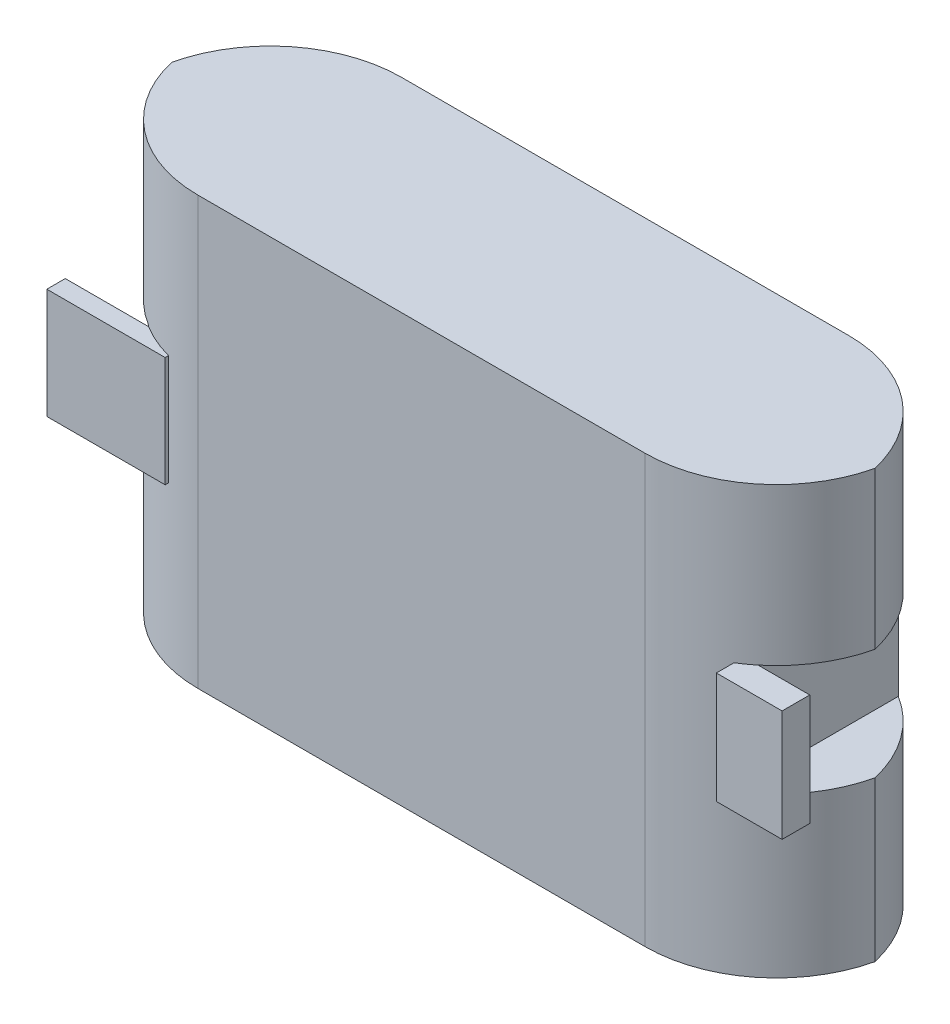
ISO-10303-21;
HEADER;
FILE_DESCRIPTION(('STEP AP214'),'2;1');
FILE_NAME('part.step','',(''),(''),'','','');
FILE_SCHEMA(('AUTOMOTIVE_DESIGN { 1 0 10303 214 1 1 1 1 }'));
ENDSEC;
DATA;
#1=APPLICATION_CONTEXT('core data for automotive mechanical design processes');
#2=APPLICATION_PROTOCOL_DEFINITION('international standard','automotive_design',2000,#1);
#3=PRODUCT_CONTEXT('',#1,'mechanical');
#4=PRODUCT('Part','Part','',(#3));
#5=PRODUCT_RELATED_PRODUCT_CATEGORY('part','',(#4));
#6=PRODUCT_DEFINITION_FORMATION('','',#4);
#7=PRODUCT_DEFINITION_CONTEXT('part definition',#1,'design');
#8=PRODUCT_DEFINITION('design','',#6,#7);
#9=PRODUCT_DEFINITION_SHAPE('','',#8);
#10=(LENGTH_UNIT() NAMED_UNIT(*) SI_UNIT(.MILLI.,.METRE.));
#11=(NAMED_UNIT(*) PLANE_ANGLE_UNIT() SI_UNIT($,.RADIAN.));
#12=(NAMED_UNIT(*) SI_UNIT($,.STERADIAN.) SOLID_ANGLE_UNIT());
#13=UNCERTAINTY_MEASURE_WITH_UNIT(LENGTH_MEASURE(1.E-05),#10,'distance_accuracy_value','');
#14=(GEOMETRIC_REPRESENTATION_CONTEXT(3) GLOBAL_UNCERTAINTY_ASSIGNED_CONTEXT((#13)) GLOBAL_UNIT_ASSIGNED_CONTEXT((#10,
#11,#12)) REPRESENTATION_CONTEXT('',''));
#15=CARTESIAN_POINT('',(0.,0.,0.));
#16=DIRECTION('',(0.,0.,1.));
#17=DIRECTION('',(1.,0.,0.));
#18=AXIS2_PLACEMENT_3D('',#15,#16,#17);
#19=CARTESIAN_POINT('',(63.5325033349829,12.9386866433361,28.));
#20=DIRECTION('',(0.,1.,0.));
#21=DIRECTION('',(0.,0.,1.));
#22=AXIS2_PLACEMENT_3D('',#19,#20,#21);
#23=PLANE('',#22);
#24=DIRECTION('',(-1.,0.,0.));
#25=VECTOR('',#24,1.);
#26=CARTESIAN_POINT('',(61.9962264458655,12.9386866433361,26.4710557876526));
#27=LINE('',#26,#25);
#28=CARTESIAN_POINT('',(54.1305620661384,12.9386866433361,26.4710557876526));
#29=VERTEX_POINT('',#28);
#30=CARTESIAN_POINT('',(51.9962264458655,12.9386866433361,26.4710557876526));
#31=VERTEX_POINT('',#30);
#32=EDGE_CURVE('E54',#29,#31,#27,.T.);
#33=ORIENTED_EDGE('',*,*,#32,.T.);
#34=DIRECTION('',(0.,0.,-1.));
#35=VECTOR('',#34,1.);
#36=CARTESIAN_POINT('',(51.9962264458655,12.9386866433361,28.));
#37=LINE('',#36,#35);
#38=CARTESIAN_POINT('',(51.9962264458655,12.9386866433361,3.00288145802275));
#39=VERTEX_POINT('',#38);
#40=EDGE_CURVE('E262',#31,#39,#37,.T.);
#41=ORIENTED_EDGE('',*,*,#40,.T.);
#42=CARTESIAN_POINT('',(41.4559246821601,12.9386866433361,20.));
#43=DIRECTION('',(0.,1.,0.));
#44=DIRECTION('',(0.,0.,1.));
#45=AXIS2_PLACEMENT_3D('',#42,#43,#44);
#46=CIRCLE('',#45,20.);
#47=CARTESIAN_POINT('',(60.9430999520651,12.9386866433361,15.5));
#48=VERTEX_POINT('',#47);
#49=EDGE_CURVE('E328',#39,#48,#46,.F.);
#50=ORIENTED_EDGE('',*,*,#49,.T.);
#51=CARTESIAN_POINT('',(41.4559246821601,12.9386866433361,11.));
#52=DIRECTION('',(0.,1.,0.));
#53=DIRECTION('',(0.,0.,1.));
#54=AXIS2_PLACEMENT_3D('',#51,#52,#53);
#55=CIRCLE('',#54,20.);
#56=EDGE_CURVE('E272',#48,#29,#55,.F.);
#57=ORIENTED_EDGE('',*,*,#56,.T.);
#58=EDGE_LOOP('',(#33,#41,#50,#57));
#59=FACE_BOUND('',#58,.T.);
#60=ADVANCED_FACE('F32',(#59),#23,.F.);
#61=CARTESIAN_POINT('',(51.9962264458655,12.9386866433361,28.));
#62=DIRECTION('',(-1.,0.,0.));
#63=DIRECTION('',(0.,0.,1.));
#64=AXIS2_PLACEMENT_3D('',#61,#62,#63);
#65=PLANE('',#64);
#66=DIRECTION('',(0.,1.,0.));
#67=VECTOR('',#66,1.);
#68=CARTESIAN_POINT('',(51.9962264458655,12.9386866433361,26.4710557876526));
#69=LINE('',#68,#67);
#70=CARTESIAN_POINT('',(51.9962264458655,-3.98873727723092,26.4710557876526));
#71=VERTEX_POINT('',#70);
#72=EDGE_CURVE('E594',#71,#31,#69,.T.);
#73=ORIENTED_EDGE('',*,*,#72,.F.);
#74=DIRECTION('',(0.,0.,-1.));
#75=VECTOR('',#74,1.);
#76=CARTESIAN_POINT('',(51.9962264458655,-3.98873727723092,28.));
#77=LINE('',#76,#75);
#78=CARTESIAN_POINT('',(51.9962264458655,-3.98873727723092,3.00288145802274));
#79=VERTEX_POINT('',#78);
#80=EDGE_CURVE('E261',#71,#79,#77,.T.);
#81=ORIENTED_EDGE('',*,*,#80,.T.);
#82=DIRECTION('',(0.,1.,0.));
#83=VECTOR('',#82,1.);
#84=CARTESIAN_POINT('',(51.9962264458655,36.7845192091454,3.00288145802275));
#85=LINE('',#84,#83);
#86=EDGE_CURVE('E325',#79,#39,#85,.T.);
#87=ORIENTED_EDGE('',*,*,#86,.T.);
#88=ORIENTED_EDGE('',*,*,#40,.F.);
#89=EDGE_LOOP('',(#73,#81,#87,#88));
#90=FACE_BOUND('',#89,.T.);
#91=ADVANCED_FACE('F381',(#90),#65,.F.);
#92=CARTESIAN_POINT('',(63.5325033349829,-3.98873727723092,28.));
#93=DIRECTION('',(0.,-1.,0.));
#94=DIRECTION('',(0.,0.,-1.));
#95=AXIS2_PLACEMENT_3D('',#92,#93,#94);
#96=PLANE('',#95);
#97=DIRECTION('',(-1.,0.,0.));
#98=VECTOR('',#97,1.);
#99=CARTESIAN_POINT('',(63.5325033349829,-3.98873727723092,26.4710557876526));
#100=LINE('',#99,#98);
#101=CARTESIAN_POINT('',(54.1305620661384,-3.98873727723092,26.4710557876526));
#102=VERTEX_POINT('',#101);
#103=EDGE_CURVE('E11',#102,#71,#100,.T.);
#104=ORIENTED_EDGE('',*,*,#103,.F.);
#105=CARTESIAN_POINT('',(41.4559246821601,-3.98873727723092,11.));
#106=DIRECTION('',(0.,-1.,0.));
#107=DIRECTION('',(0.,0.,-1.));
#108=AXIS2_PLACEMENT_3D('',#105,#106,#107);
#109=CIRCLE('',#108,20.);
#110=CARTESIAN_POINT('',(60.9430999520651,-3.98873727723092,15.5));
#111=VERTEX_POINT('',#110);
#112=EDGE_CURVE('E264',#102,#111,#109,.F.);
#113=ORIENTED_EDGE('',*,*,#112,.T.);
#114=CARTESIAN_POINT('',(41.4559246821601,-3.98873727723092,20.));
#115=DIRECTION('',(0.,-1.,0.));
#116=DIRECTION('',(0.,0.,-1.));
#117=AXIS2_PLACEMENT_3D('',#114,#115,#116);
#118=CIRCLE('',#117,20.);
#119=EDGE_CURVE('E316',#111,#79,#118,.F.);
#120=ORIENTED_EDGE('',*,*,#119,.T.);
#121=ORIENTED_EDGE('',*,*,#80,.F.);
#122=EDGE_LOOP('',(#104,#113,#120,#121));
#123=FACE_BOUND('',#122,.T.);
#124=ADVANCED_FACE('F386',(#123),#96,.F.);
#125=CARTESIAN_POINT('',(-26.5440753178399,0.,11.));
#126=DIRECTION('',(0.,1.,0.));
#127=DIRECTION('',(0.,0.,1.));
#128=AXIS2_PLACEMENT_3D('',#125,#126,#127);
#129=CYLINDRICAL_SURFACE('',#128,20.);
#130=CARTESIAN_POINT('',(-26.5440753178399,-3.98873727723092,11.));
#131=DIRECTION('',(0.,-1.,0.));
#132=DIRECTION('',(0.,0.,-1.));
#133=AXIS2_PLACEMENT_3D('',#130,#131,#132);
#134=CIRCLE('',#133,20.);
#135=CARTESIAN_POINT('',(-46.031250587745,-3.98873727723092,15.5));
#136=VERTEX_POINT('',#135);
#137=CARTESIAN_POINT('',(-37.0797290706927,-3.98873727723092,28.));
#138=VERTEX_POINT('',#137);
#139=EDGE_CURVE('E334',#136,#138,#134,.F.);
#140=ORIENTED_EDGE('',*,*,#139,.F.);
#141=DIRECTION('',(0.,-1.,0.));
#142=VECTOR('',#141,1.);
#143=CARTESIAN_POINT('',(-46.031250587745,4.28451920914537,15.5));
#144=LINE('',#143,#142);
#145=CARTESIAN_POINT('',(-46.031250587745,-28.2154807908546,15.5));
#146=VERTEX_POINT('',#145);
#147=EDGE_CURVE('E274',#136,#146,#144,.T.);
#148=ORIENTED_EDGE('',*,*,#147,.T.);
#149=CARTESIAN_POINT('',(-26.5440753178399,-28.2154807908546,11.));
#150=DIRECTION('',(0.,1.,0.));
#151=DIRECTION('',(0.,0.,1.));
#152=AXIS2_PLACEMENT_3D('',#149,#150,#151);
#153=CIRCLE('',#152,20.);
#154=CARTESIAN_POINT('',(-26.5440753178399,-28.2154807908546,31.));
#155=VERTEX_POINT('',#154);
#156=EDGE_CURVE('E303',#155,#146,#153,.F.);
#157=ORIENTED_EDGE('',*,*,#156,.F.);
#158=DIRECTION('',(0.,-1.,0.));
#159=VECTOR('',#158,1.);
#160=CARTESIAN_POINT('',(-26.5440753178399,-28.2154807908546,31.));
#161=LINE('',#160,#159);
#162=CARTESIAN_POINT('',(-26.5440753178399,36.7845192091454,31.));
#163=VERTEX_POINT('',#162);
#164=EDGE_CURVE('E311',#163,#155,#161,.T.);
#165=ORIENTED_EDGE('',*,*,#164,.F.);
#166=CARTESIAN_POINT('',(-26.5440753178399,36.7845192091454,11.));
#167=DIRECTION('',(0.,-1.,0.));
#168=DIRECTION('',(0.,0.,-1.));
#169=AXIS2_PLACEMENT_3D('',#166,#167,#168);
#170=CIRCLE('',#169,20.);
#171=CARTESIAN_POINT('',(-46.031250587745,36.7845192091454,15.5));
#172=VERTEX_POINT('',#171);
#173=EDGE_CURVE('E290',#172,#163,#170,.F.);
#174=ORIENTED_EDGE('',*,*,#173,.F.);
#175=CARTESIAN_POINT('',(-46.031250587745,12.9386866433361,15.5));
#176=VERTEX_POINT('',#175);
#177=EDGE_CURVE('E320',#172,#176,#144,.T.);
#178=ORIENTED_EDGE('',*,*,#177,.T.);
#179=CARTESIAN_POINT('',(-26.5440753178399,12.9386866433361,11.));
#180=DIRECTION('',(0.,1.,0.));
#181=DIRECTION('',(0.,0.,1.));
#182=AXIS2_PLACEMENT_3D('',#179,#180,#181);
#183=CIRCLE('',#182,20.);
#184=CARTESIAN_POINT('',(-37.0797290706927,12.9386866433361,28.));
#185=VERTEX_POINT('',#184);
#186=EDGE_CURVE('E332',#185,#176,#183,.F.);
#187=ORIENTED_EDGE('',*,*,#186,.F.);
#188=DIRECTION('',(0.,1.,0.));
#189=VECTOR('',#188,1.);
#190=CARTESIAN_POINT('',(-37.0797290706927,0.,28.));
#191=LINE('',#190,#189);
#192=EDGE_CURVE('E330',#138,#185,#191,.T.);
#193=ORIENTED_EDGE('',*,*,#192,.F.);
#194=EDGE_LOOP('',(#140,#148,#157,#165,#174,#178,#187,#193));
#195=FACE_BOUND('',#194,.T.);
#196=CARTESIAN_POINT('',(-26.5440753178399,-4.04277729188784,11.));
#197=DIRECTION('',(0.,1.,0.));
#198=DIRECTION('',(0.,0.,1.));
#199=AXIS2_PLACEMENT_3D('',#196,#197,#198);
#200=CIRCLE('',#199,20.);
#201=CARTESIAN_POINT('',(-31.6963827693399,-4.04277729188784,30.3249509165022));
#202=VERTEX_POINT('',#201);
#203=CARTESIAN_POINT('',(-37.0358921717604,-4.04277729188784,28.0270895664465));
#204=VERTEX_POINT('',#203);
#205=EDGE_CURVE('E345',#202,#204,#200,.F.);
#206=ORIENTED_EDGE('',*,*,#205,.T.);
#207=DIRECTION('',(0.,1.,0.));
#208=VECTOR('',#207,1.);
#209=CARTESIAN_POINT('',(-37.0358921717604,0.,28.0270895664465));
#210=LINE('',#209,#208);
#211=CARTESIAN_POINT('',(-37.0358921717604,12.7269551482598,28.0270895664465));
#212=VERTEX_POINT('',#211);
#213=EDGE_CURVE('E40',#204,#212,#210,.T.);
#214=ORIENTED_EDGE('',*,*,#213,.T.);
#215=CARTESIAN_POINT('',(-26.5440753178399,12.7269551482598,11.));
#216=DIRECTION('',(0.,-1.,0.));
#217=DIRECTION('',(0.,0.,-1.));
#218=AXIS2_PLACEMENT_3D('',#215,#216,#217);
#219=CIRCLE('',#218,20.);
#220=CARTESIAN_POINT('',(-31.6963827693399,12.7269551482598,30.3249509165022));
#221=VERTEX_POINT('',#220);
#222=EDGE_CURVE('E342',#212,#221,#219,.F.);
#223=ORIENTED_EDGE('',*,*,#222,.T.);
#224=DIRECTION('',(0.,1.,0.));
#225=VECTOR('',#224,1.);
#226=CARTESIAN_POINT('',(-31.6963827693399,0.,30.3249509165022));
#227=LINE('',#226,#225);
#228=EDGE_CURVE('E339',#221,#202,#227,.F.);
#229=ORIENTED_EDGE('',*,*,#228,.T.);
#230=EDGE_LOOP('',(#206,#214,#223,#229));
#231=FACE_BOUND('',#230,.T.);
#232=ADVANCED_FACE('F349',(#195,#231),#129,.T.);
#233=CARTESIAN_POINT('',(-46.5440753178399,-28.2154807908546,31.));
#234=DIRECTION('',(0.,1.,0.));
#235=DIRECTION('',(0.,0.,1.));
#236=AXIS2_PLACEMENT_3D('',#233,#234,#235);
#237=PLANE('',#236);
#238=DIRECTION('',(1.,0.,0.));
#239=VECTOR('',#238,1.);
#240=CARTESIAN_POINT('',(-46.5440753178399,-28.2154807908546,0.));
#241=LINE('',#240,#239);
#242=CARTESIAN_POINT('',(-26.5440753178399,-28.2154807908546,0.));
#243=VERTEX_POINT('',#242);
#244=CARTESIAN_POINT('',(41.4559246821601,-28.2154807908546,0.));
#245=VERTEX_POINT('',#244);
#246=EDGE_CURVE('E283',#243,#245,#241,.T.);
#247=ORIENTED_EDGE('',*,*,#246,.T.);
#248=CARTESIAN_POINT('',(41.4559246821601,-28.2154807908546,20.));
#249=DIRECTION('',(0.,1.,0.));
#250=DIRECTION('',(0.,0.,1.));
#251=AXIS2_PLACEMENT_3D('',#248,#249,#250);
#252=CIRCLE('',#251,20.);
#253=CARTESIAN_POINT('',(60.9430999520651,-28.2154807908546,15.5));
#254=VERTEX_POINT('',#253);
#255=EDGE_CURVE('E308',#245,#254,#252,.F.);
#256=ORIENTED_EDGE('',*,*,#255,.T.);
#257=CARTESIAN_POINT('',(41.4559246821601,-28.2154807908546,11.));
#258=DIRECTION('',(0.,1.,0.));
#259=DIRECTION('',(0.,0.,1.));
#260=AXIS2_PLACEMENT_3D('',#257,#258,#259);
#261=CIRCLE('',#260,20.);
#262=CARTESIAN_POINT('',(41.4559246821601,-28.2154807908546,31.));
#263=VERTEX_POINT('',#262);
#264=EDGE_CURVE('E306',#254,#263,#261,.F.);
#265=ORIENTED_EDGE('',*,*,#264,.T.);
#266=DIRECTION('',(1.,0.,0.));
#267=VECTOR('',#266,1.);
#268=CARTESIAN_POINT('',(-46.5440753178399,-28.2154807908546,31.));
#269=LINE('',#268,#267);
#270=EDGE_CURVE('E275',#155,#263,#269,.T.);
#271=ORIENTED_EDGE('',*,*,#270,.F.);
#272=ORIENTED_EDGE('',*,*,#156,.T.);
#273=CARTESIAN_POINT('',(-26.5440753178399,-28.2154807908546,20.));
#274=DIRECTION('',(0.,1.,0.));
#275=DIRECTION('',(0.,0.,1.));
#276=AXIS2_PLACEMENT_3D('',#273,#274,#275);
#277=CIRCLE('',#276,20.);
#278=EDGE_CURVE('E301',#146,#243,#277,.F.);
#279=ORIENTED_EDGE('',*,*,#278,.T.);
#280=EDGE_LOOP('',(#247,#256,#265,#271,#272,#279));
#281=FACE_BOUND('',#280,.T.);
#282=ADVANCED_FACE('F408',(#281),#237,.F.);
#283=CARTESIAN_POINT('',(-46.5440753178399,36.7845192091454,31.));
#284=DIRECTION('',(0.,-1.,0.));
#285=DIRECTION('',(0.,0.,-1.));
#286=AXIS2_PLACEMENT_3D('',#283,#284,#285);
#287=PLANE('',#286);
#288=CARTESIAN_POINT('',(41.4559246821601,36.7845192091454,11.));
#289=DIRECTION('',(0.,-1.,0.));
#290=DIRECTION('',(0.,0.,-1.));
#291=AXIS2_PLACEMENT_3D('',#288,#289,#290);
#292=CIRCLE('',#291,20.);
#293=CARTESIAN_POINT('',(41.4559246821601,36.7845192091454,31.));
#294=VERTEX_POINT('',#293);
#295=CARTESIAN_POINT('',(60.9430999520651,36.7845192091454,15.5));
#296=VERTEX_POINT('',#295);
#297=EDGE_CURVE('E292',#294,#296,#292,.F.);
#298=ORIENTED_EDGE('',*,*,#297,.T.);
#299=CARTESIAN_POINT('',(41.4559246821601,36.7845192091454,20.));
#300=DIRECTION('',(0.,-1.,0.));
#301=DIRECTION('',(0.,0.,-1.));
#302=AXIS2_PLACEMENT_3D('',#299,#300,#301);
#303=CIRCLE('',#302,20.);
#304=CARTESIAN_POINT('',(41.4559246821601,36.7845192091454,0.));
#305=VERTEX_POINT('',#304);
#306=EDGE_CURVE('E294',#296,#305,#303,.F.);
#307=ORIENTED_EDGE('',*,*,#306,.T.);
#308=DIRECTION('',(-1.,0.,0.));
#309=VECTOR('',#308,1.);
#310=CARTESIAN_POINT('',(-46.5440753178399,36.7845192091454,0.));
#311=LINE('',#310,#309);
#312=CARTESIAN_POINT('',(-26.5440753178399,36.7845192091454,0.));
#313=VERTEX_POINT('',#312);
#314=EDGE_CURVE('E279',#305,#313,#311,.T.);
#315=ORIENTED_EDGE('',*,*,#314,.T.);
#316=CARTESIAN_POINT('',(-26.5440753178399,36.7845192091454,20.));
#317=DIRECTION('',(0.,-1.,0.));
#318=DIRECTION('',(0.,0.,-1.));
#319=AXIS2_PLACEMENT_3D('',#316,#317,#318);
#320=CIRCLE('',#319,20.);
#321=EDGE_CURVE('E282',#313,#172,#320,.F.);
#322=ORIENTED_EDGE('',*,*,#321,.T.);
#323=ORIENTED_EDGE('',*,*,#173,.T.);
#324=DIRECTION('',(-1.,0.,0.));
#325=VECTOR('',#324,1.);
#326=CARTESIAN_POINT('',(-46.5440753178399,36.7845192091454,31.));
#327=LINE('',#326,#325);
#328=EDGE_CURVE('E278',#294,#163,#327,.T.);
#329=ORIENTED_EDGE('',*,*,#328,.F.);
#330=EDGE_LOOP('',(#298,#307,#315,#322,#323,#329));
#331=FACE_BOUND('',#330,.T.);
#332=ADVANCED_FACE('F400',(#331),#287,.F.);
#333=CARTESIAN_POINT('',(0.,0.,31.));
#334=DIRECTION('',(0.,0.,1.));
#335=DIRECTION('',(1.,0.,0.));
#336=AXIS2_PLACEMENT_3D('',#333,#334,#335);
#337=PLANE('',#336);
#338=ORIENTED_EDGE('',*,*,#270,.T.);
#339=DIRECTION('',(0.,1.,0.));
#340=VECTOR('',#339,1.);
#341=CARTESIAN_POINT('',(41.4559246821601,36.7845192091454,31.));
#342=LINE('',#341,#340);
#343=EDGE_CURVE('E314',#263,#294,#342,.T.);
#344=ORIENTED_EDGE('',*,*,#343,.T.);
#345=ORIENTED_EDGE('',*,*,#328,.T.);
#346=ORIENTED_EDGE('',*,*,#164,.T.);
#347=EDGE_LOOP('',(#338,#344,#345,#346));
#348=FACE_BOUND('',#347,.T.);
#349=ADVANCED_FACE('F396',(#348),#337,.T.);
#350=CARTESIAN_POINT('',(0.,0.,0.));
#351=DIRECTION('',(0.,0.,1.));
#352=DIRECTION('',(1.,0.,0.));
#353=AXIS2_PLACEMENT_3D('',#350,#351,#352);
#354=PLANE('',#353);
#355=ORIENTED_EDGE('',*,*,#314,.F.);
#356=DIRECTION('',(0.,1.,0.));
#357=VECTOR('',#356,1.);
#358=CARTESIAN_POINT('',(41.4559246821601,0.,0.));
#359=LINE('',#358,#357);
#360=EDGE_CURVE('E298',#305,#245,#359,.F.);
#361=ORIENTED_EDGE('',*,*,#360,.T.);
#362=ORIENTED_EDGE('',*,*,#246,.F.);
#363=DIRECTION('',(0.,-1.,0.));
#364=VECTOR('',#363,1.);
#365=CARTESIAN_POINT('',(-26.5440753178399,0.,0.));
#366=LINE('',#365,#364);
#367=EDGE_CURVE('E296',#243,#313,#366,.F.);
#368=ORIENTED_EDGE('',*,*,#367,.T.);
#369=EDGE_LOOP('',(#355,#361,#362,#368));
#370=FACE_BOUND('',#369,.T.);
#371=ADVANCED_FACE('F399',(#370),#354,.F.);
#372=CARTESIAN_POINT('',(41.4559246821601,0.,11.));
#373=DIRECTION('',(0.,-1.,0.));
#374=DIRECTION('',(1.,0.,0.));
#375=AXIS2_PLACEMENT_3D('',#372,#373,#374);
#376=CYLINDRICAL_SURFACE('',#375,20.);
#377=ORIENTED_EDGE('',*,*,#56,.F.);
#378=DIRECTION('',(0.,-1.,0.));
#379=VECTOR('',#378,1.);
#380=CARTESIAN_POINT('',(60.9430999520651,4.28451920914537,15.5));
#381=LINE('',#380,#379);
#382=EDGE_CURVE('E286',#296,#48,#381,.T.);
#383=ORIENTED_EDGE('',*,*,#382,.F.);
#384=ORIENTED_EDGE('',*,*,#297,.F.);
#385=ORIENTED_EDGE('',*,*,#343,.F.);
#386=ORIENTED_EDGE('',*,*,#264,.F.);
#387=EDGE_CURVE('E319',#111,#254,#381,.T.);
#388=ORIENTED_EDGE('',*,*,#387,.F.);
#389=ORIENTED_EDGE('',*,*,#112,.F.);
#390=CARTESIAN_POINT('',(51.9962264458655,-3.98873727723092,27.9971185419773));
#391=VERTEX_POINT('',#390);
#392=EDGE_CURVE('E266',#391,#102,#109,.F.);
#393=ORIENTED_EDGE('',*,*,#392,.F.);
#394=DIRECTION('',(0.,-1.,0.));
#395=VECTOR('',#394,1.);
#396=CARTESIAN_POINT('',(51.9962264458655,0.,27.9971185419773));
#397=LINE('',#396,#395);
#398=CARTESIAN_POINT('',(51.9962264458655,12.9386866433361,27.9971185419773));
#399=VERTEX_POINT('',#398);
#400=EDGE_CURVE('E269',#399,#391,#397,.T.);
#401=ORIENTED_EDGE('',*,*,#400,.F.);
#402=CARTESIAN_POINT('',(41.4559246821601,12.9386866433361,11.));
#403=DIRECTION('',(0.,-1.,0.));
#404=DIRECTION('',(0.,0.,-1.));
#405=AXIS2_PLACEMENT_3D('',#402,#403,#404);
#406=CIRCLE('',#405,20.);
#407=EDGE_CURVE('E47',#399,#29,#406,.F.);
#408=ORIENTED_EDGE('',*,*,#407,.T.);
#409=EDGE_LOOP('',(#377,#383,#384,#385,#386,#388,#389,#393,#401,#408));
#410=FACE_BOUND('',#409,.T.);
#411=ADVANCED_FACE('F404',(#410),#376,.T.);
#412=CARTESIAN_POINT('',(41.4559246821601,36.7845192091454,20.));
#413=DIRECTION('',(0.,1.,0.));
#414=DIRECTION('',(-1.,0.,0.));
#415=AXIS2_PLACEMENT_3D('',#412,#413,#414);
#416=CYLINDRICAL_SURFACE('',#415,20.);
#417=ORIENTED_EDGE('',*,*,#49,.F.);
#418=ORIENTED_EDGE('',*,*,#86,.F.);
#419=ORIENTED_EDGE('',*,*,#119,.F.);
#420=ORIENTED_EDGE('',*,*,#387,.T.);
#421=ORIENTED_EDGE('',*,*,#255,.F.);
#422=ORIENTED_EDGE('',*,*,#360,.F.);
#423=ORIENTED_EDGE('',*,*,#306,.F.);
#424=ORIENTED_EDGE('',*,*,#382,.T.);
#425=EDGE_LOOP('',(#417,#418,#419,#420,#421,#422,#423,#424));
#426=FACE_BOUND('',#425,.T.);
#427=ADVANCED_FACE('F413',(#426),#416,.T.);
#428=CARTESIAN_POINT('',(-26.5440753178399,36.7845192091454,20.));
#429=DIRECTION('',(0.,-1.,0.));
#430=DIRECTION('',(0.,0.,-1.));
#431=AXIS2_PLACEMENT_3D('',#428,#429,#430);
#432=CYLINDRICAL_SURFACE('',#431,20.);
#433=CARTESIAN_POINT('',(-26.5440753178399,-3.98873727723092,20.));
#434=DIRECTION('',(0.,-1.,0.));
#435=DIRECTION('',(0.,0.,-1.));
#436=AXIS2_PLACEMENT_3D('',#433,#434,#435);
#437=CIRCLE('',#436,20.);
#438=CARTESIAN_POINT('',(-31.6963827693399,-3.98873727723092,0.675049083497848));
#439=VERTEX_POINT('',#438);
#440=EDGE_CURVE('E259',#439,#136,#437,.F.);
#441=ORIENTED_EDGE('',*,*,#440,.F.);
#442=DIRECTION('',(0.,-1.,0.));
#443=VECTOR('',#442,1.);
#444=CARTESIAN_POINT('',(-31.6963827693399,36.7845192091454,0.675049083497848));
#445=LINE('',#444,#443);
#446=CARTESIAN_POINT('',(-31.6963827693399,12.9386866433361,0.675049083497848));
#447=VERTEX_POINT('',#446);
#448=EDGE_CURVE('E337',#447,#439,#445,.T.);
#449=ORIENTED_EDGE('',*,*,#448,.F.);
#450=CARTESIAN_POINT('',(-26.5440753178399,12.9386866433361,20.));
#451=DIRECTION('',(0.,1.,0.));
#452=DIRECTION('',(0.,0.,1.));
#453=AXIS2_PLACEMENT_3D('',#450,#451,#452);
#454=CIRCLE('',#453,20.);
#455=EDGE_CURVE('E255',#176,#447,#454,.F.);
#456=ORIENTED_EDGE('',*,*,#455,.F.);
#457=ORIENTED_EDGE('',*,*,#177,.F.);
#458=ORIENTED_EDGE('',*,*,#321,.F.);
#459=ORIENTED_EDGE('',*,*,#367,.F.);
#460=ORIENTED_EDGE('',*,*,#278,.F.);
#461=ORIENTED_EDGE('',*,*,#147,.F.);
#462=EDGE_LOOP('',(#441,#449,#456,#457,#458,#459,#460,#461));
#463=FACE_BOUND('',#462,.T.);
#464=ADVANCED_FACE('F34',(#463),#432,.T.);
#465=CARTESIAN_POINT('',(-57.9649877840751,-3.98873727723092,28.));
#466=DIRECTION('',(0.,-1.,0.));
#467=DIRECTION('',(0.,0.,-1.));
#468=AXIS2_PLACEMENT_3D('',#465,#466,#467);
#469=PLANE('',#468);
#470=ORIENTED_EDGE('',*,*,#440,.T.);
#471=ORIENTED_EDGE('',*,*,#139,.T.);
#472=DIRECTION('',(-1.,0.,0.));
#473=VECTOR('',#472,1.);
#474=CARTESIAN_POINT('',(-57.9649877840751,-3.98873727723092,28.));
#475=LINE('',#474,#473);
#476=CARTESIAN_POINT('',(-31.6963827693399,-3.98873727723092,28.));
#477=VERTEX_POINT('',#476);
#478=EDGE_CURVE('E249',#477,#138,#475,.T.);
#479=ORIENTED_EDGE('',*,*,#478,.F.);
#480=DIRECTION('',(0.,0.,-1.));
#481=VECTOR('',#480,1.);
#482=CARTESIAN_POINT('',(-31.6963827693399,-3.98873727723092,28.));
#483=LINE('',#482,#481);
#484=EDGE_CURVE('E252',#477,#439,#483,.T.);
#485=ORIENTED_EDGE('',*,*,#484,.T.);
#486=EDGE_LOOP('',(#470,#471,#479,#485));
#487=FACE_BOUND('',#486,.T.);
#488=ADVANCED_FACE('F460',(#487),#469,.F.);
#489=CARTESIAN_POINT('',(-31.6963827693399,12.9386866433361,28.));
#490=DIRECTION('',(1.,0.,0.));
#491=DIRECTION('',(0.,0.,-1.));
#492=AXIS2_PLACEMENT_3D('',#489,#490,#491);
#493=PLANE('',#492);
#494=ORIENTED_EDGE('',*,*,#448,.T.);
#495=ORIENTED_EDGE('',*,*,#484,.F.);
#496=DIRECTION('',(0.,-1.,0.));
#497=VECTOR('',#496,1.);
#498=CARTESIAN_POINT('',(-31.6963827693399,12.9386866433361,28.));
#499=LINE('',#498,#497);
#500=CARTESIAN_POINT('',(-31.6963827693399,12.9386866433361,28.));
#501=VERTEX_POINT('',#500);
#502=EDGE_CURVE('E246',#501,#477,#499,.T.);
#503=ORIENTED_EDGE('',*,*,#502,.F.);
#504=DIRECTION('',(0.,0.,-1.));
#505=VECTOR('',#504,1.);
#506=CARTESIAN_POINT('',(-31.6963827693399,12.9386866433361,28.));
#507=LINE('',#506,#505);
#508=EDGE_CURVE('E251',#501,#447,#507,.T.);
#509=ORIENTED_EDGE('',*,*,#508,.T.);
#510=EDGE_LOOP('',(#494,#495,#503,#509));
#511=FACE_BOUND('',#510,.T.);
#512=ADVANCED_FACE('F457',(#511),#493,.F.);
#513=CARTESIAN_POINT('',(-57.9649877840751,12.9386866433361,28.));
#514=DIRECTION('',(0.,1.,0.));
#515=DIRECTION('',(0.,0.,1.));
#516=AXIS2_PLACEMENT_3D('',#513,#514,#515);
#517=PLANE('',#516);
#518=ORIENTED_EDGE('',*,*,#455,.T.);
#519=ORIENTED_EDGE('',*,*,#508,.F.);
#520=DIRECTION('',(1.,0.,0.));
#521=VECTOR('',#520,1.);
#522=CARTESIAN_POINT('',(-57.9649877840751,12.9386866433361,28.));
#523=LINE('',#522,#521);
#524=EDGE_CURVE('E244',#185,#501,#523,.T.);
#525=ORIENTED_EDGE('',*,*,#524,.F.);
#526=ORIENTED_EDGE('',*,*,#186,.T.);
#527=EDGE_LOOP('',(#518,#519,#525,#526));
#528=FACE_BOUND('',#527,.T.);
#529=ADVANCED_FACE('F390',(#528),#517,.F.);
#530=CARTESIAN_POINT('',(0.,0.,28.));
#531=DIRECTION('',(0.,0.,1.));
#532=DIRECTION('',(1.,0.,0.));
#533=AXIS2_PLACEMENT_3D('',#530,#531,#532);
#534=PLANE('',#533);
#535=ORIENTED_EDGE('',*,*,#192,.T.);
#536=ORIENTED_EDGE('',*,*,#524,.T.);
#537=ORIENTED_EDGE('',*,*,#502,.T.);
#538=ORIENTED_EDGE('',*,*,#478,.T.);
#539=EDGE_LOOP('',(#535,#536,#537,#538));
#540=FACE_BOUND('',#539,.T.);
#541=ADVANCED_FACE('F459',(#540),#534,.F.);
#542=CARTESIAN_POINT('',(-49.6963827693399,12.7269551482598,28.0270895664465));
#543=DIRECTION('',(0.,0.,1.));
#544=DIRECTION('',(1.,0.,0.));
#545=AXIS2_PLACEMENT_3D('',#542,#543,#544);
#546=PLANE('',#545);
#547=ORIENTED_EDGE('',*,*,#213,.F.);
#548=DIRECTION('',(1.,0.,0.));
#549=VECTOR('',#548,1.);
#550=CARTESIAN_POINT('',(-49.6963827693399,-4.04277729188784,28.0270895664465));
#551=LINE('',#550,#549);
#552=CARTESIAN_POINT('',(-49.6963827693399,-4.04277729188784,28.0270895664465));
#553=VERTEX_POINT('',#552);
#554=EDGE_CURVE('E241',#553,#204,#551,.T.);
#555=ORIENTED_EDGE('',*,*,#554,.F.);
#556=DIRECTION('',(0.,-1.,0.));
#557=VECTOR('',#556,1.);
#558=CARTESIAN_POINT('',(-49.6963827693399,12.7269551482598,28.0270895664465));
#559=LINE('',#558,#557);
#560=CARTESIAN_POINT('',(-49.6963827693399,12.7269551482598,28.0270895664465));
#561=VERTEX_POINT('',#560);
#562=EDGE_CURVE('E217',#561,#553,#559,.T.);
#563=ORIENTED_EDGE('',*,*,#562,.F.);
#564=DIRECTION('',(1.,0.,0.));
#565=VECTOR('',#564,1.);
#566=CARTESIAN_POINT('',(-49.6963827693399,12.7269551482598,28.0270895664465));
#567=LINE('',#566,#565);
#568=EDGE_CURVE('E227',#561,#212,#567,.T.);
#569=ORIENTED_EDGE('',*,*,#568,.T.);
#570=EDGE_LOOP('',(#547,#555,#563,#569));
#571=FACE_BOUND('',#570,.T.);
#572=ADVANCED_FACE('F353',(#571),#546,.F.);
#573=CARTESIAN_POINT('',(-49.6963827693399,-4.04277729188784,28.0270895664465));
#574=DIRECTION('',(0.,1.,0.));
#575=DIRECTION('',(0.,0.,1.));
#576=AXIS2_PLACEMENT_3D('',#573,#574,#575);
#577=PLANE('',#576);
#578=ORIENTED_EDGE('',*,*,#205,.F.);
#579=DIRECTION('',(0.,0.,1.));
#580=VECTOR('',#579,1.);
#581=CARTESIAN_POINT('',(-31.6963827693399,-4.04277729188784,28.0270895664465));
#582=LINE('',#581,#580);
#583=CARTESIAN_POINT('',(-31.6963827693399,-4.04277729188784,30.8325033122046));
#584=VERTEX_POINT('',#583);
#585=EDGE_CURVE('E212',#202,#584,#582,.T.);
#586=ORIENTED_EDGE('',*,*,#585,.T.);
#587=DIRECTION('',(1.,0.,0.));
#588=VECTOR('',#587,1.);
#589=CARTESIAN_POINT('',(-49.6963827693399,-4.04277729188784,30.8325033122046));
#590=LINE('',#589,#588);
#591=CARTESIAN_POINT('',(-49.6963827693399,-4.04277729188784,30.8325033122046));
#592=VERTEX_POINT('',#591);
#593=EDGE_CURVE('E238',#592,#584,#590,.T.);
#594=ORIENTED_EDGE('',*,*,#593,.F.);
#595=DIRECTION('',(0.,0.,1.));
#596=VECTOR('',#595,1.);
#597=CARTESIAN_POINT('',(-49.6963827693399,-4.04277729188784,28.0270895664465));
#598=LINE('',#597,#596);
#599=EDGE_CURVE('E220',#553,#592,#598,.T.);
#600=ORIENTED_EDGE('',*,*,#599,.F.);
#601=ORIENTED_EDGE('',*,*,#554,.T.);
#602=EDGE_LOOP('',(#578,#586,#594,#600,#601));
#603=FACE_BOUND('',#602,.T.);
#604=ADVANCED_FACE('F357',(#603),#577,.F.);
#605=CARTESIAN_POINT('',(-49.6963827693399,12.7269551482598,30.8325033122046));
#606=DIRECTION('',(0.,0.,-1.));
#607=DIRECTION('',(-1.,0.,0.));
#608=AXIS2_PLACEMENT_3D('',#605,#606,#607);
#609=PLANE('',#608);
#610=DIRECTION('',(0.,1.,0.));
#611=VECTOR('',#610,1.);
#612=CARTESIAN_POINT('',(-31.6963827693399,12.7269551482598,30.8325033122046));
#613=LINE('',#612,#611);
#614=CARTESIAN_POINT('',(-31.6963827693399,12.7269551482598,30.8325033122046));
#615=VERTEX_POINT('',#614);
#616=EDGE_CURVE('E229',#584,#615,#613,.T.);
#617=ORIENTED_EDGE('',*,*,#616,.T.);
#618=DIRECTION('',(1.,0.,0.));
#619=VECTOR('',#618,1.);
#620=CARTESIAN_POINT('',(-49.6963827693399,12.7269551482598,30.8325033122046));
#621=LINE('',#620,#619);
#622=CARTESIAN_POINT('',(-49.6963827693399,12.7269551482598,30.8325033122046));
#623=VERTEX_POINT('',#622);
#624=EDGE_CURVE('E235',#623,#615,#621,.T.);
#625=ORIENTED_EDGE('',*,*,#624,.F.);
#626=DIRECTION('',(0.,1.,0.));
#627=VECTOR('',#626,1.);
#628=CARTESIAN_POINT('',(-49.6963827693399,12.7269551482598,30.8325033122046));
#629=LINE('',#628,#627);
#630=EDGE_CURVE('E223',#592,#623,#629,.T.);
#631=ORIENTED_EDGE('',*,*,#630,.F.);
#632=ORIENTED_EDGE('',*,*,#593,.T.);
#633=EDGE_LOOP('',(#617,#625,#631,#632));
#634=FACE_BOUND('',#633,.T.);
#635=ADVANCED_FACE('F371',(#634),#609,.F.);
#636=CARTESIAN_POINT('',(-49.6963827693399,12.7269551482598,28.0270895664465));
#637=DIRECTION('',(0.,-1.,0.));
#638=DIRECTION('',(0.,0.,-1.));
#639=AXIS2_PLACEMENT_3D('',#636,#637,#638);
#640=PLANE('',#639);
#641=ORIENTED_EDGE('',*,*,#222,.F.);
#642=ORIENTED_EDGE('',*,*,#568,.F.);
#643=DIRECTION('',(0.,0.,-1.));
#644=VECTOR('',#643,1.);
#645=CARTESIAN_POINT('',(-49.6963827693399,12.7269551482598,28.0270895664465));
#646=LINE('',#645,#644);
#647=EDGE_CURVE('E225',#623,#561,#646,.T.);
#648=ORIENTED_EDGE('',*,*,#647,.F.);
#649=ORIENTED_EDGE('',*,*,#624,.T.);
#650=DIRECTION('',(0.,0.,-1.));
#651=VECTOR('',#650,1.);
#652=CARTESIAN_POINT('',(-31.6963827693399,12.7269551482598,28.0270895664465));
#653=LINE('',#652,#651);
#654=EDGE_CURVE('E221',#615,#221,#653,.T.);
#655=ORIENTED_EDGE('',*,*,#654,.T.);
#656=EDGE_LOOP('',(#641,#642,#648,#649,#655));
#657=FACE_BOUND('',#656,.T.);
#658=ADVANCED_FACE('F365',(#657),#640,.F.);
#659=CARTESIAN_POINT('',(-49.6963827693399,0.,0.));
#660=DIRECTION('',(-1.,0.,0.));
#661=DIRECTION('',(0.,0.,1.));
#662=AXIS2_PLACEMENT_3D('',#659,#660,#661);
#663=PLANE('',#662);
#664=ORIENTED_EDGE('',*,*,#562,.T.);
#665=ORIENTED_EDGE('',*,*,#599,.T.);
#666=ORIENTED_EDGE('',*,*,#630,.T.);
#667=ORIENTED_EDGE('',*,*,#647,.T.);
#668=EDGE_LOOP('',(#664,#665,#666,#667));
#669=FACE_BOUND('',#668,.T.);
#670=ADVANCED_FACE('F361',(#669),#663,.T.);
#671=CARTESIAN_POINT('',(-31.6963827693399,0.,0.));
#672=DIRECTION('',(-1.,0.,0.));
#673=DIRECTION('',(0.,0.,1.));
#674=AXIS2_PLACEMENT_3D('',#671,#672,#673);
#675=PLANE('',#674);
#676=ORIENTED_EDGE('',*,*,#228,.F.);
#677=ORIENTED_EDGE('',*,*,#654,.F.);
#678=ORIENTED_EDGE('',*,*,#616,.F.);
#679=ORIENTED_EDGE('',*,*,#585,.F.);
#680=EDGE_LOOP('',(#676,#677,#678,#679));
#681=FACE_BOUND('',#680,.T.);
#682=ADVANCED_FACE('F369',(#681),#675,.F.);
#683=CARTESIAN_POINT('',(61.9962264458655,12.9386866433361,26.4710557876526));
#684=DIRECTION('',(0.,0.,1.));
#685=DIRECTION('',(1.,0.,0.));
#686=AXIS2_PLACEMENT_3D('',#683,#684,#685);
#687=PLANE('',#686);
#688=ORIENTED_EDGE('',*,*,#72,.T.);
#689=ORIENTED_EDGE('',*,*,#32,.F.);
#690=CARTESIAN_POINT('',(61.9962264458655,12.9386866433361,26.4710557876526));
#691=VERTEX_POINT('',#690);
#692=EDGE_CURVE('E192',#691,#29,#27,.T.);
#693=ORIENTED_EDGE('',*,*,#692,.F.);
#694=DIRECTION('',(0.,1.,0.));
#695=VECTOR('',#694,1.);
#696=CARTESIAN_POINT('',(61.9962264458655,12.9386866433361,26.4710557876526));
#697=LINE('',#696,#695);
#698=CARTESIAN_POINT('',(61.9962264458655,-3.98873727723092,26.4710557876526));
#699=VERTEX_POINT('',#698);
#700=EDGE_CURVE('E198',#699,#691,#697,.T.);
#701=ORIENTED_EDGE('',*,*,#700,.F.);
#702=DIRECTION('',(-1.,0.,0.));
#703=VECTOR('',#702,1.);
#704=CARTESIAN_POINT('',(61.9962264458655,-3.98873727723092,26.4710557876526));
#705=LINE('',#704,#703);
#706=EDGE_CURVE('E601',#699,#102,#705,.T.);
#707=ORIENTED_EDGE('',*,*,#706,.T.);
#708=ORIENTED_EDGE('',*,*,#103,.T.);
#709=EDGE_LOOP('',(#688,#689,#693,#701,#707,#708));
#710=FACE_BOUND('',#709,.T.);
#711=ADVANCED_FACE('F210',(#710),#687,.F.);
#712=CARTESIAN_POINT('',(61.9962264458655,12.9386866433361,26.4710557876526));
#713=DIRECTION('',(0.,-1.,0.));
#714=DIRECTION('',(0.,0.,-1.));
#715=AXIS2_PLACEMENT_3D('',#712,#713,#714);
#716=PLANE('',#715);
#717=ORIENTED_EDGE('',*,*,#407,.F.);
#718=DIRECTION('',(0.,0.,1.));
#719=VECTOR('',#718,1.);
#720=CARTESIAN_POINT('',(51.9962264458655,12.9386866433361,26.4710557876526));
#721=LINE('',#720,#719);
#722=CARTESIAN_POINT('',(51.9962264458655,12.9386866433361,30.6781551046864));
#723=VERTEX_POINT('',#722);
#724=EDGE_CURVE('E590',#399,#723,#721,.T.);
#725=ORIENTED_EDGE('',*,*,#724,.T.);
#726=DIRECTION('',(-1.,0.,0.));
#727=VECTOR('',#726,1.);
#728=CARTESIAN_POINT('',(61.9962264458655,12.9386866433361,30.6781551046864));
#729=LINE('',#728,#727);
#730=CARTESIAN_POINT('',(61.9962264458655,12.9386866433361,30.6781551046864));
#731=VERTEX_POINT('',#730);
#732=EDGE_CURVE('E194',#731,#723,#729,.T.);
#733=ORIENTED_EDGE('',*,*,#732,.F.);
#734=DIRECTION('',(0.,0.,1.));
#735=VECTOR('',#734,1.);
#736=CARTESIAN_POINT('',(61.9962264458655,12.9386866433361,26.4710557876526));
#737=LINE('',#736,#735);
#738=EDGE_CURVE('E188',#691,#731,#737,.T.);
#739=ORIENTED_EDGE('',*,*,#738,.F.);
#740=ORIENTED_EDGE('',*,*,#692,.T.);
#741=EDGE_LOOP('',(#717,#725,#733,#739,#740));
#742=FACE_BOUND('',#741,.T.);
#743=ADVANCED_FACE('F190',(#742),#716,.F.);
#744=CARTESIAN_POINT('',(61.9962264458655,12.9386866433361,30.6781551046864));
#745=DIRECTION('',(0.,0.,-1.));
#746=DIRECTION('',(-1.,0.,0.));
#747=AXIS2_PLACEMENT_3D('',#744,#745,#746);
#748=PLANE('',#747);
#749=DIRECTION('',(0.,-1.,0.));
#750=VECTOR('',#749,1.);
#751=CARTESIAN_POINT('',(51.9962264458655,12.9386866433361,30.6781551046864));
#752=LINE('',#751,#750);
#753=CARTESIAN_POINT('',(51.9962264458655,-3.98873727723092,30.6781551046864));
#754=VERTEX_POINT('',#753);
#755=EDGE_CURVE('E593',#723,#754,#752,.T.);
#756=ORIENTED_EDGE('',*,*,#755,.T.);
#757=DIRECTION('',(-1.,0.,0.));
#758=VECTOR('',#757,1.);
#759=CARTESIAN_POINT('',(61.9962264458655,-3.98873727723092,30.6781551046864));
#760=LINE('',#759,#758);
#761=CARTESIAN_POINT('',(61.9962264458655,-3.98873727723092,30.6781551046864));
#762=VERTEX_POINT('',#761);
#763=EDGE_CURVE('E602',#762,#754,#760,.T.);
#764=ORIENTED_EDGE('',*,*,#763,.F.);
#765=DIRECTION('',(0.,-1.,0.));
#766=VECTOR('',#765,1.);
#767=CARTESIAN_POINT('',(61.9962264458655,12.9386866433361,30.6781551046864));
#768=LINE('',#767,#766);
#769=EDGE_CURVE('E197',#731,#762,#768,.T.);
#770=ORIENTED_EDGE('',*,*,#769,.F.);
#771=ORIENTED_EDGE('',*,*,#732,.T.);
#772=EDGE_LOOP('',(#756,#764,#770,#771));
#773=FACE_BOUND('',#772,.T.);
#774=ADVANCED_FACE('F547',(#773),#748,.F.);
#775=CARTESIAN_POINT('',(61.9962264458655,-3.98873727723092,26.4710557876526));
#776=DIRECTION('',(0.,1.,0.));
#777=DIRECTION('',(0.,0.,1.));
#778=AXIS2_PLACEMENT_3D('',#775,#776,#777);
#779=PLANE('',#778);
#780=ORIENTED_EDGE('',*,*,#392,.T.);
#781=ORIENTED_EDGE('',*,*,#706,.F.);
#782=DIRECTION('',(0.,0.,-1.));
#783=VECTOR('',#782,1.);
#784=CARTESIAN_POINT('',(61.9962264458655,-3.98873727723092,26.4710557876526));
#785=LINE('',#784,#783);
#786=EDGE_CURVE('E203',#762,#699,#785,.T.);
#787=ORIENTED_EDGE('',*,*,#786,.F.);
#788=ORIENTED_EDGE('',*,*,#763,.T.);
#789=DIRECTION('',(0.,0.,-1.));
#790=VECTOR('',#789,1.);
#791=CARTESIAN_POINT('',(51.9962264458655,-3.98873727723092,26.4710557876526));
#792=LINE('',#791,#790);
#793=EDGE_CURVE('E207',#754,#391,#792,.T.);
#794=ORIENTED_EDGE('',*,*,#793,.T.);
#795=EDGE_LOOP('',(#780,#781,#787,#788,#794));
#796=FACE_BOUND('',#795,.T.);
#797=ADVANCED_FACE('F556',(#796),#779,.F.);
#798=CARTESIAN_POINT('',(61.9962264458655,0.,0.));
#799=DIRECTION('',(-1.,0.,0.));
#800=DIRECTION('',(0.,0.,1.));
#801=AXIS2_PLACEMENT_3D('',#798,#799,#800);
#802=PLANE('',#801);
#803=ORIENTED_EDGE('',*,*,#700,.T.);
#804=ORIENTED_EDGE('',*,*,#738,.T.);
#805=ORIENTED_EDGE('',*,*,#769,.T.);
#806=ORIENTED_EDGE('',*,*,#786,.T.);
#807=EDGE_LOOP('',(#803,#804,#805,#806));
#808=FACE_BOUND('',#807,.T.);
#809=ADVANCED_FACE('F201',(#808),#802,.F.);
#810=CARTESIAN_POINT('',(51.9962264458655,0.,0.));
#811=DIRECTION('',(-1.,0.,0.));
#812=DIRECTION('',(0.,0.,1.));
#813=AXIS2_PLACEMENT_3D('',#810,#811,#812);
#814=PLANE('',#813);
#815=ORIENTED_EDGE('',*,*,#724,.F.);
#816=ORIENTED_EDGE('',*,*,#400,.T.);
#817=ORIENTED_EDGE('',*,*,#793,.F.);
#818=ORIENTED_EDGE('',*,*,#755,.F.);
#819=EDGE_LOOP('',(#815,#816,#817,#818));
#820=FACE_BOUND('',#819,.T.);
#821=ADVANCED_FACE('F575',(#820),#814,.T.);
#822=CLOSED_SHELL('',(#60,#91,#124,#232,#282,#332,#349,#371,#411,#427,#464,#488,#512,#529,#541,
#572,#604,#635,#658,#670,#682,#711,#743,#774,#797,#809,#821));
#823=MANIFOLD_SOLID_BREP('B2',#822);
#824=ADVANCED_BREP_SHAPE_REPRESENTATION('',(#18,#823),#14);
#825=SHAPE_DEFINITION_REPRESENTATION(#9,#824);
ENDSEC;
END-ISO-10303-21;
